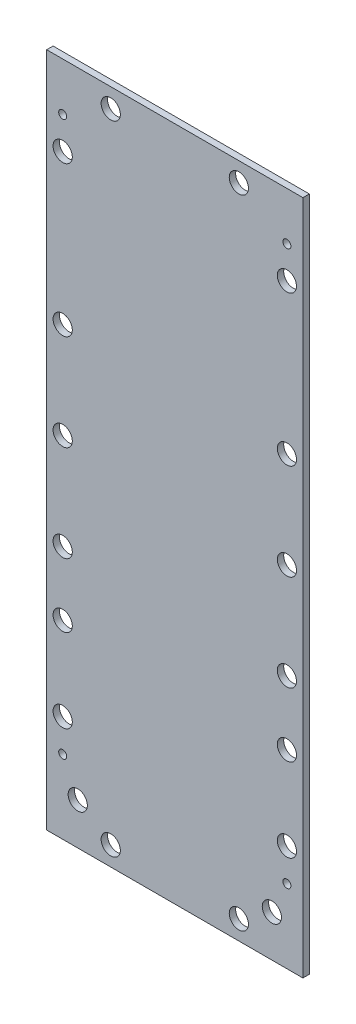
ISO-10303-21;
HEADER;
FILE_DESCRIPTION(('STEP AP214'),'2;1');
FILE_NAME('part.step','',(''),(''),'','','');
FILE_SCHEMA(('AUTOMOTIVE_DESIGN { 1 0 10303 214 1 1 1 1 }'));
ENDSEC;
DATA;
#1=APPLICATION_CONTEXT('core data for automotive mechanical design processes');
#2=APPLICATION_PROTOCOL_DEFINITION('international standard','automotive_design',2000,#1);
#3=PRODUCT_CONTEXT('',#1,'mechanical');
#4=PRODUCT('Part','Part','',(#3));
#5=PRODUCT_RELATED_PRODUCT_CATEGORY('part','',(#4));
#6=PRODUCT_DEFINITION_FORMATION('','',#4);
#7=PRODUCT_DEFINITION_CONTEXT('part definition',#1,'design');
#8=PRODUCT_DEFINITION('design','',#6,#7);
#9=PRODUCT_DEFINITION_SHAPE('','',#8);
#10=(LENGTH_UNIT() NAMED_UNIT(*) SI_UNIT(.MILLI.,.METRE.));
#11=(NAMED_UNIT(*) PLANE_ANGLE_UNIT() SI_UNIT($,.RADIAN.));
#12=(NAMED_UNIT(*) SI_UNIT($,.STERADIAN.) SOLID_ANGLE_UNIT());
#13=UNCERTAINTY_MEASURE_WITH_UNIT(LENGTH_MEASURE(1.E-05),#10,'distance_accuracy_value','');
#14=(GEOMETRIC_REPRESENTATION_CONTEXT(3) GLOBAL_UNCERTAINTY_ASSIGNED_CONTEXT((#13)) GLOBAL_UNIT_ASSIGNED_CONTEXT((#10,
#11,#12)) REPRESENTATION_CONTEXT('',''));
#15=CARTESIAN_POINT('',(0.,0.,0.));
#16=DIRECTION('',(0.,0.,1.));
#17=DIRECTION('',(1.,0.,0.));
#18=AXIS2_PLACEMENT_3D('',#15,#16,#17);
#19=CARTESIAN_POINT('',(80.,0.,2.));
#20=DIRECTION('',(0.,1.,0.));
#21=DIRECTION('',(0.,0.,1.));
#22=AXIS2_PLACEMENT_3D('',#19,#20,#21);
#23=PLANE('',#22);
#24=DIRECTION('',(1.,0.,0.));
#25=VECTOR('',#24,1.);
#26=CARTESIAN_POINT('',(80.,0.,0.));
#27=LINE('',#26,#25);
#28=CARTESIAN_POINT('',(0.,0.,0.));
#29=VERTEX_POINT('',#28);
#30=CARTESIAN_POINT('',(80.,0.,0.));
#31=VERTEX_POINT('',#30);
#32=EDGE_CURVE('E109',#29,#31,#27,.T.);
#33=ORIENTED_EDGE('',*,*,#32,.T.);
#34=DIRECTION('',(0.,0.,-1.));
#35=VECTOR('',#34,1.);
#36=CARTESIAN_POINT('',(80.,0.,2.));
#37=LINE('',#36,#35);
#38=CARTESIAN_POINT('',(80.,0.,2.));
#39=VERTEX_POINT('',#38);
#40=EDGE_CURVE('E11',#39,#31,#37,.T.);
#41=ORIENTED_EDGE('',*,*,#40,.F.);
#42=DIRECTION('',(1.,0.,0.));
#43=VECTOR('',#42,1.);
#44=CARTESIAN_POINT('',(80.,0.,2.));
#45=LINE('',#44,#43);
#46=CARTESIAN_POINT('',(0.,0.,2.));
#47=VERTEX_POINT('',#46);
#48=EDGE_CURVE('E92',#47,#39,#45,.T.);
#49=ORIENTED_EDGE('',*,*,#48,.F.);
#50=DIRECTION('',(0.,0.,-1.));
#51=VECTOR('',#50,1.);
#52=CARTESIAN_POINT('',(0.,0.,2.));
#53=LINE('',#52,#51);
#54=EDGE_CURVE('E105',#47,#29,#53,.T.);
#55=ORIENTED_EDGE('',*,*,#54,.T.);
#56=EDGE_LOOP('',(#33,#41,#49,#55));
#57=FACE_BOUND('',#56,.T.);
#58=ADVANCED_FACE('F38',(#57),#23,.F.);
#59=CARTESIAN_POINT('',(80.,211.,2.));
#60=DIRECTION('',(-1.,0.,0.));
#61=DIRECTION('',(0.,0.,1.));
#62=AXIS2_PLACEMENT_3D('',#59,#60,#61);
#63=PLANE('',#62);
#64=DIRECTION('',(0.,1.,0.));
#65=VECTOR('',#64,1.);
#66=CARTESIAN_POINT('',(80.,211.,0.));
#67=LINE('',#66,#65);
#68=CARTESIAN_POINT('',(80.,211.,0.));
#69=VERTEX_POINT('',#68);
#70=EDGE_CURVE('E97',#31,#69,#67,.T.);
#71=ORIENTED_EDGE('',*,*,#70,.T.);
#72=DIRECTION('',(0.,0.,-1.));
#73=VECTOR('',#72,1.);
#74=CARTESIAN_POINT('',(80.,211.,2.));
#75=LINE('',#74,#73);
#76=CARTESIAN_POINT('',(80.,211.,2.));
#77=VERTEX_POINT('',#76);
#78=EDGE_CURVE('E48',#77,#69,#75,.T.);
#79=ORIENTED_EDGE('',*,*,#78,.F.);
#80=DIRECTION('',(0.,1.,0.));
#81=VECTOR('',#80,1.);
#82=CARTESIAN_POINT('',(80.,211.,2.));
#83=LINE('',#82,#81);
#84=EDGE_CURVE('E87',#39,#77,#83,.T.);
#85=ORIENTED_EDGE('',*,*,#84,.F.);
#86=ORIENTED_EDGE('',*,*,#40,.T.);
#87=EDGE_LOOP('',(#71,#79,#85,#86));
#88=FACE_BOUND('',#87,.T.);
#89=ADVANCED_FACE('F96',(#88),#63,.F.);
#90=CARTESIAN_POINT('',(0.,211.,2.));
#91=DIRECTION('',(0.,-1.,0.));
#92=DIRECTION('',(0.,0.,-1.));
#93=AXIS2_PLACEMENT_3D('',#90,#91,#92);
#94=PLANE('',#93);
#95=DIRECTION('',(-1.,0.,0.));
#96=VECTOR('',#95,1.);
#97=CARTESIAN_POINT('',(0.,211.,0.));
#98=LINE('',#97,#96);
#99=CARTESIAN_POINT('',(0.,211.,0.));
#100=VERTEX_POINT('',#99);
#101=EDGE_CURVE('E74',#69,#100,#98,.T.);
#102=ORIENTED_EDGE('',*,*,#101,.T.);
#103=DIRECTION('',(0.,0.,-1.));
#104=VECTOR('',#103,1.);
#105=CARTESIAN_POINT('',(0.,211.,2.));
#106=LINE('',#105,#104);
#107=CARTESIAN_POINT('',(0.,211.,2.));
#108=VERTEX_POINT('',#107);
#109=EDGE_CURVE('E99',#108,#100,#106,.T.);
#110=ORIENTED_EDGE('',*,*,#109,.F.);
#111=DIRECTION('',(-1.,0.,0.));
#112=VECTOR('',#111,1.);
#113=CARTESIAN_POINT('',(0.,211.,2.));
#114=LINE('',#113,#112);
#115=EDGE_CURVE('E90',#77,#108,#114,.T.);
#116=ORIENTED_EDGE('',*,*,#115,.F.);
#117=ORIENTED_EDGE('',*,*,#78,.T.);
#118=EDGE_LOOP('',(#102,#110,#116,#117));
#119=FACE_BOUND('',#118,.T.);
#120=ADVANCED_FACE('F101',(#119),#94,.F.);
#121=CARTESIAN_POINT('',(0.,0.,2.));
#122=DIRECTION('',(1.,0.,0.));
#123=DIRECTION('',(0.,0.,-1.));
#124=AXIS2_PLACEMENT_3D('',#121,#122,#123);
#125=PLANE('',#124);
#126=DIRECTION('',(0.,-1.,0.));
#127=VECTOR('',#126,1.);
#128=CARTESIAN_POINT('',(0.,0.,0.));
#129=LINE('',#128,#127);
#130=EDGE_CURVE('E80',#100,#29,#129,.T.);
#131=ORIENTED_EDGE('',*,*,#130,.T.);
#132=ORIENTED_EDGE('',*,*,#54,.F.);
#133=DIRECTION('',(0.,-1.,0.));
#134=VECTOR('',#133,1.);
#135=CARTESIAN_POINT('',(0.,0.,2.));
#136=LINE('',#135,#134);
#137=EDGE_CURVE('E57',#108,#47,#136,.T.);
#138=ORIENTED_EDGE('',*,*,#137,.F.);
#139=ORIENTED_EDGE('',*,*,#109,.T.);
#140=EDGE_LOOP('',(#131,#132,#138,#139));
#141=FACE_BOUND('',#140,.T.);
#142=ADVANCED_FACE('F173',(#141),#125,.F.);
#143=CARTESIAN_POINT('',(0.,0.,2.));
#144=DIRECTION('',(0.,0.,-1.));
#145=DIRECTION('',(-1.,0.,0.));
#146=AXIS2_PLACEMENT_3D('',#143,#144,#145);
#147=PLANE('',#146);
#148=CARTESIAN_POINT('',(20.,205.,2.));
#149=DIRECTION('',(0.,0.,-1.));
#150=DIRECTION('',(-1.,0.,0.));
#151=AXIS2_PLACEMENT_3D('',#148,#149,#150);
#152=CIRCLE('',#151,3.);
#153=CARTESIAN_POINT('',(17.,205.,2.));
#154=VERTEX_POINT('',#153);
#155=EDGE_CURVE('E424',#154,#154,#152,.F.);
#156=ORIENTED_EDGE('',*,*,#155,.F.);
#157=EDGE_LOOP('',(#156));
#158=FACE_BOUND('',#157,.T.);
#159=CARTESIAN_POINT('',(4.99999999999998,33.2,2.));
#160=DIRECTION('',(0.,0.,-1.));
#161=DIRECTION('',(-1.,0.,0.));
#162=AXIS2_PLACEMENT_3D('',#159,#160,#161);
#163=CIRCLE('',#162,3.);
#164=CARTESIAN_POINT('',(1.99999999999998,33.2,2.));
#165=VERTEX_POINT('',#164);
#166=EDGE_CURVE('E439',#165,#165,#163,.F.);
#167=ORIENTED_EDGE('',*,*,#166,.F.);
#168=EDGE_LOOP('',(#167));
#169=FACE_BOUND('',#168,.T.);
#170=CARTESIAN_POINT('',(4.99999999999999,59.2,2.));
#171=DIRECTION('',(0.,0.,-1.));
#172=DIRECTION('',(-1.,0.,0.));
#173=AXIS2_PLACEMENT_3D('',#170,#171,#172);
#174=CIRCLE('',#173,3.);
#175=CARTESIAN_POINT('',(1.99999999999998,59.2,2.));
#176=VERTEX_POINT('',#175);
#177=EDGE_CURVE('E447',#176,#176,#174,.F.);
#178=ORIENTED_EDGE('',*,*,#177,.F.);
#179=EDGE_LOOP('',(#178));
#180=FACE_BOUND('',#179,.T.);
#181=CARTESIAN_POINT('',(5.00000000000002,79.2,2.));
#182=DIRECTION('',(0.,0.,-1.));
#183=DIRECTION('',(-1.,0.,0.));
#184=AXIS2_PLACEMENT_3D('',#181,#182,#183);
#185=CIRCLE('',#184,3.);
#186=CARTESIAN_POINT('',(2.00000000000001,79.2,2.));
#187=VERTEX_POINT('',#186);
#188=EDGE_CURVE('E446',#187,#187,#185,.F.);
#189=ORIENTED_EDGE('',*,*,#188,.F.);
#190=EDGE_LOOP('',(#189));
#191=FACE_BOUND('',#190,.T.);
#192=CARTESIAN_POINT('',(60.,5.99999999999999,2.));
#193=DIRECTION('',(0.,0.,-1.));
#194=DIRECTION('',(-1.,0.,0.));
#195=AXIS2_PLACEMENT_3D('',#192,#193,#194);
#196=CIRCLE('',#195,3.);
#197=CARTESIAN_POINT('',(57.,5.99999999999999,2.));
#198=VERTEX_POINT('',#197);
#199=EDGE_CURVE('E429',#198,#198,#196,.F.);
#200=ORIENTED_EDGE('',*,*,#199,.F.);
#201=EDGE_LOOP('',(#200));
#202=FACE_BOUND('',#201,.T.);
#203=CARTESIAN_POINT('',(20.,5.99999999999999,2.));
#204=DIRECTION('',(0.,0.,-1.));
#205=DIRECTION('',(-1.,0.,0.));
#206=AXIS2_PLACEMENT_3D('',#203,#204,#205);
#207=CIRCLE('',#206,2.99999999999999);
#208=CARTESIAN_POINT('',(17.,5.99999999999999,2.));
#209=VERTEX_POINT('',#208);
#210=EDGE_CURVE('E569',#209,#209,#207,.F.);
#211=ORIENTED_EDGE('',*,*,#210,.F.);
#212=EDGE_LOOP('',(#211));
#213=FACE_BOUND('',#212,.T.);
#214=CARTESIAN_POINT('',(70.3,13.,2.));
#215=DIRECTION('',(0.,0.,-1.));
#216=DIRECTION('',(-1.,0.,0.));
#217=AXIS2_PLACEMENT_3D('',#214,#215,#216);
#218=CIRCLE('',#217,3.00000000000001);
#219=CARTESIAN_POINT('',(67.3,13.,2.));
#220=VERTEX_POINT('',#219);
#221=EDGE_CURVE('E561',#220,#220,#218,.F.);
#222=ORIENTED_EDGE('',*,*,#221,.F.);
#223=EDGE_LOOP('',(#222));
#224=FACE_BOUND('',#223,.T.);
#225=CARTESIAN_POINT('',(60.,205.,2.));
#226=DIRECTION('',(0.,0.,-1.));
#227=DIRECTION('',(-1.,0.,0.));
#228=AXIS2_PLACEMENT_3D('',#225,#226,#227);
#229=CIRCLE('',#228,3.);
#230=CARTESIAN_POINT('',(57.,205.,2.));
#231=VERTEX_POINT('',#230);
#232=EDGE_CURVE('E551',#231,#231,#229,.F.);
#233=ORIENTED_EDGE('',*,*,#232,.F.);
#234=EDGE_LOOP('',(#233));
#235=FACE_BOUND('',#234,.T.);
#236=CARTESIAN_POINT('',(75.,139.2,2.));
#237=DIRECTION('',(0.,0.,-1.));
#238=DIRECTION('',(-1.,0.,0.));
#239=AXIS2_PLACEMENT_3D('',#236,#237,#238);
#240=CIRCLE('',#239,3.00000000000001);
#241=CARTESIAN_POINT('',(72.,139.2,2.));
#242=VERTEX_POINT('',#241);
#243=EDGE_CURVE('E495',#242,#242,#240,.F.);
#244=ORIENTED_EDGE('',*,*,#243,.F.);
#245=EDGE_LOOP('',(#244));
#246=FACE_BOUND('',#245,.T.);
#247=CARTESIAN_POINT('',(75.,109.2,2.));
#248=DIRECTION('',(0.,0.,-1.));
#249=DIRECTION('',(-1.,0.,0.));
#250=AXIS2_PLACEMENT_3D('',#247,#248,#249);
#251=CIRCLE('',#250,3.00000000000001);
#252=CARTESIAN_POINT('',(72.,109.2,2.));
#253=VERTEX_POINT('',#252);
#254=EDGE_CURVE('E496',#253,#253,#251,.F.);
#255=ORIENTED_EDGE('',*,*,#254,.F.);
#256=EDGE_LOOP('',(#255));
#257=FACE_BOUND('',#256,.T.);
#258=CARTESIAN_POINT('',(75.,79.2,2.));
#259=DIRECTION('',(0.,0.,-1.));
#260=DIRECTION('',(-1.,0.,0.));
#261=AXIS2_PLACEMENT_3D('',#258,#259,#260);
#262=CIRCLE('',#261,3.00000000000001);
#263=CARTESIAN_POINT('',(72.,79.2,2.));
#264=VERTEX_POINT('',#263);
#265=EDGE_CURVE('E505',#264,#264,#262,.F.);
#266=ORIENTED_EDGE('',*,*,#265,.F.);
#267=EDGE_LOOP('',(#266));
#268=FACE_BOUND('',#267,.T.);
#269=CARTESIAN_POINT('',(75.,59.2,2.));
#270=DIRECTION('',(0.,0.,-1.));
#271=DIRECTION('',(-1.,0.,0.));
#272=AXIS2_PLACEMENT_3D('',#269,#270,#271);
#273=CIRCLE('',#272,3.00000000000001);
#274=CARTESIAN_POINT('',(72.,59.2,2.));
#275=VERTEX_POINT('',#274);
#276=EDGE_CURVE('E513',#275,#275,#273,.F.);
#277=ORIENTED_EDGE('',*,*,#276,.F.);
#278=EDGE_LOOP('',(#277));
#279=FACE_BOUND('',#278,.T.);
#280=CARTESIAN_POINT('',(5.00000000000002,109.2,2.));
#281=DIRECTION('',(0.,0.,-1.));
#282=DIRECTION('',(-1.,0.,0.));
#283=AXIS2_PLACEMENT_3D('',#280,#281,#282);
#284=CIRCLE('',#283,3.);
#285=CARTESIAN_POINT('',(2.00000000000002,109.2,2.));
#286=VERTEX_POINT('',#285);
#287=EDGE_CURVE('E464',#286,#286,#284,.F.);
#288=ORIENTED_EDGE('',*,*,#287,.F.);
#289=EDGE_LOOP('',(#288));
#290=FACE_BOUND('',#289,.T.);
#291=CARTESIAN_POINT('',(5.00000000000002,139.2,2.));
#292=DIRECTION('',(0.,0.,-1.));
#293=DIRECTION('',(-1.,0.,0.));
#294=AXIS2_PLACEMENT_3D('',#291,#292,#293);
#295=CIRCLE('',#294,3.);
#296=CARTESIAN_POINT('',(2.00000000000002,139.2,2.));
#297=VERTEX_POINT('',#296);
#298=EDGE_CURVE('E463',#297,#297,#295,.F.);
#299=ORIENTED_EDGE('',*,*,#298,.F.);
#300=EDGE_LOOP('',(#299));
#301=FACE_BOUND('',#300,.T.);
#302=CARTESIAN_POINT('',(5.00000000000003,186.,2.));
#303=DIRECTION('',(0.,0.,-1.));
#304=DIRECTION('',(-1.,0.,0.));
#305=AXIS2_PLACEMENT_3D('',#302,#303,#304);
#306=CIRCLE('',#305,3.);
#307=CARTESIAN_POINT('',(2.00000000000003,186.,2.));
#308=VERTEX_POINT('',#307);
#309=EDGE_CURVE('E480',#308,#308,#306,.F.);
#310=ORIENTED_EDGE('',*,*,#309,.F.);
#311=EDGE_LOOP('',(#310));
#312=FACE_BOUND('',#311,.T.);
#313=CARTESIAN_POINT('',(75.,33.2,2.));
#314=DIRECTION('',(0.,0.,-1.));
#315=DIRECTION('',(-1.,0.,0.));
#316=AXIS2_PLACEMENT_3D('',#313,#314,#315);
#317=CIRCLE('',#316,3.00000000000001);
#318=CARTESIAN_POINT('',(72.,33.2,2.));
#319=VERTEX_POINT('',#318);
#320=EDGE_CURVE('E479',#319,#319,#317,.F.);
#321=ORIENTED_EDGE('',*,*,#320,.F.);
#322=EDGE_LOOP('',(#321));
#323=FACE_BOUND('',#322,.T.);
#324=CARTESIAN_POINT('',(9.7,13.,2.));
#325=DIRECTION('',(0.,0.,-1.));
#326=DIRECTION('',(-1.,0.,0.));
#327=AXIS2_PLACEMENT_3D('',#324,#325,#326);
#328=CIRCLE('',#327,3.);
#329=CARTESIAN_POINT('',(6.7,13.,2.));
#330=VERTEX_POINT('',#329);
#331=EDGE_CURVE('E560',#330,#330,#328,.F.);
#332=ORIENTED_EDGE('',*,*,#331,.F.);
#333=EDGE_LOOP('',(#332));
#334=FACE_BOUND('',#333,.T.);
#335=CARTESIAN_POINT('',(75.,186.,2.));
#336=DIRECTION('',(0.,0.,-1.));
#337=DIRECTION('',(-1.,0.,0.));
#338=AXIS2_PLACEMENT_3D('',#335,#336,#337);
#339=CIRCLE('',#338,3.00000000000001);
#340=CARTESIAN_POINT('',(72.,186.,2.));
#341=VERTEX_POINT('',#340);
#342=EDGE_CURVE('E526',#341,#341,#339,.F.);
#343=ORIENTED_EDGE('',*,*,#342,.F.);
#344=EDGE_LOOP('',(#343));
#345=FACE_BOUND('',#344,.T.);
#346=CARTESIAN_POINT('',(75.,196.,2.));
#347=DIRECTION('',(0.,0.,-1.));
#348=DIRECTION('',(-1.,0.,0.));
#349=AXIS2_PLACEMENT_3D('',#346,#347,#348);
#350=CIRCLE('',#349,1.25);
#351=CARTESIAN_POINT('',(73.75,196.,2.));
#352=VERTEX_POINT('',#351);
#353=EDGE_CURVE('E41',#352,#352,#350,.T.);
#354=ORIENTED_EDGE('',*,*,#353,.T.);
#355=EDGE_LOOP('',(#354));
#356=FACE_BOUND('',#355,.T.);
#357=CARTESIAN_POINT('',(5.00000000000003,196.,2.));
#358=DIRECTION('',(0.,0.,-1.));
#359=DIRECTION('',(-1.,0.,0.));
#360=AXIS2_PLACEMENT_3D('',#357,#358,#359);
#361=CIRCLE('',#360,1.25);
#362=CARTESIAN_POINT('',(3.75000000000003,196.,2.));
#363=VERTEX_POINT('',#362);
#364=EDGE_CURVE('E135',#363,#363,#361,.T.);
#365=ORIENTED_EDGE('',*,*,#364,.T.);
#366=EDGE_LOOP('',(#365));
#367=FACE_BOUND('',#366,.T.);
#368=CARTESIAN_POINT('',(75.,23.,2.));
#369=DIRECTION('',(0.,0.,-1.));
#370=DIRECTION('',(-1.,0.,0.));
#371=AXIS2_PLACEMENT_3D('',#368,#369,#370);
#372=CIRCLE('',#371,1.25);
#373=CARTESIAN_POINT('',(73.75,23.,2.));
#374=VERTEX_POINT('',#373);
#375=EDGE_CURVE('E123',#374,#374,#372,.T.);
#376=ORIENTED_EDGE('',*,*,#375,.T.);
#377=EDGE_LOOP('',(#376));
#378=FACE_BOUND('',#377,.T.);
#379=CARTESIAN_POINT('',(5.00000000000003,23.,2.));
#380=DIRECTION('',(0.,0.,-1.));
#381=DIRECTION('',(-1.,0.,0.));
#382=AXIS2_PLACEMENT_3D('',#379,#380,#381);
#383=CIRCLE('',#382,1.25);
#384=CARTESIAN_POINT('',(3.75000000000003,23.,2.));
#385=VERTEX_POINT('',#384);
#386=EDGE_CURVE('E113',#385,#385,#383,.T.);
#387=ORIENTED_EDGE('',*,*,#386,.T.);
#388=EDGE_LOOP('',(#387));
#389=FACE_BOUND('',#388,.T.);
#390=ORIENTED_EDGE('',*,*,#48,.T.);
#391=ORIENTED_EDGE('',*,*,#84,.T.);
#392=ORIENTED_EDGE('',*,*,#115,.T.);
#393=ORIENTED_EDGE('',*,*,#137,.T.);
#394=EDGE_LOOP('',(#390,#391,#392,#393));
#395=FACE_BOUND('',#394,.T.);
#396=ADVANCED_FACE('F88',(#158,#169,#180,#191,#202,#213,#224,#235,#246,#257,#268,#279,#290,#301,
#312,#323,#334,#345,#356,#367,#378,#389,#395),#147,.F.);
#397=CARTESIAN_POINT('',(0.,0.,0.));
#398=DIRECTION('',(0.,0.,-1.));
#399=DIRECTION('',(-1.,0.,0.));
#400=AXIS2_PLACEMENT_3D('',#397,#398,#399);
#401=PLANE('',#400);
#402=CARTESIAN_POINT('',(20.,205.,0.));
#403=DIRECTION('',(0.,0.,-1.));
#404=DIRECTION('',(-1.,0.,0.));
#405=AXIS2_PLACEMENT_3D('',#402,#403,#404);
#406=CIRCLE('',#405,3.);
#407=CARTESIAN_POINT('',(17.,205.,0.));
#408=VERTEX_POINT('',#407);
#409=EDGE_CURVE('E427',#408,#408,#406,.T.);
#410=ORIENTED_EDGE('',*,*,#409,.F.);
#411=EDGE_LOOP('',(#410));
#412=FACE_BOUND('',#411,.T.);
#413=CARTESIAN_POINT('',(4.99999999999998,33.2,0.));
#414=DIRECTION('',(0.,0.,-1.));
#415=DIRECTION('',(-1.,0.,0.));
#416=AXIS2_PLACEMENT_3D('',#413,#414,#415);
#417=CIRCLE('',#416,3.);
#418=CARTESIAN_POINT('',(1.99999999999998,33.2,0.));
#419=VERTEX_POINT('',#418);
#420=EDGE_CURVE('E433',#419,#419,#417,.T.);
#421=ORIENTED_EDGE('',*,*,#420,.F.);
#422=EDGE_LOOP('',(#421));
#423=FACE_BOUND('',#422,.T.);
#424=CARTESIAN_POINT('',(4.99999999999999,59.2,0.));
#425=DIRECTION('',(0.,0.,-1.));
#426=DIRECTION('',(-1.,0.,0.));
#427=AXIS2_PLACEMENT_3D('',#424,#425,#426);
#428=CIRCLE('',#427,3.);
#429=CARTESIAN_POINT('',(1.99999999999998,59.2,0.));
#430=VERTEX_POINT('',#429);
#431=EDGE_CURVE('E452',#430,#430,#428,.T.);
#432=ORIENTED_EDGE('',*,*,#431,.F.);
#433=EDGE_LOOP('',(#432));
#434=FACE_BOUND('',#433,.T.);
#435=CARTESIAN_POINT('',(5.00000000000002,79.2,0.));
#436=DIRECTION('',(0.,0.,-1.));
#437=DIRECTION('',(-1.,0.,0.));
#438=AXIS2_PLACEMENT_3D('',#435,#436,#437);
#439=CIRCLE('',#438,3.);
#440=CARTESIAN_POINT('',(2.00000000000001,79.2,0.));
#441=VERTEX_POINT('',#440);
#442=EDGE_CURVE('E442',#441,#441,#439,.T.);
#443=ORIENTED_EDGE('',*,*,#442,.F.);
#444=EDGE_LOOP('',(#443));
#445=FACE_BOUND('',#444,.T.);
#446=CARTESIAN_POINT('',(60.,5.99999999999999,0.));
#447=DIRECTION('',(0.,0.,-1.));
#448=DIRECTION('',(-1.,0.,0.));
#449=AXIS2_PLACEMENT_3D('',#446,#447,#448);
#450=CIRCLE('',#449,3.);
#451=CARTESIAN_POINT('',(57.,5.99999999999999,0.));
#452=VERTEX_POINT('',#451);
#453=EDGE_CURVE('E436',#452,#452,#450,.T.);
#454=ORIENTED_EDGE('',*,*,#453,.F.);
#455=EDGE_LOOP('',(#454));
#456=FACE_BOUND('',#455,.T.);
#457=CARTESIAN_POINT('',(20.,5.99999999999999,0.));
#458=DIRECTION('',(0.,0.,-1.));
#459=DIRECTION('',(-1.,0.,0.));
#460=AXIS2_PLACEMENT_3D('',#457,#458,#459);
#461=CIRCLE('',#460,2.99999999999999);
#462=CARTESIAN_POINT('',(17.,5.99999999999999,0.));
#463=VERTEX_POINT('',#462);
#464=EDGE_CURVE('E565',#463,#463,#461,.T.);
#465=ORIENTED_EDGE('',*,*,#464,.F.);
#466=EDGE_LOOP('',(#465));
#467=FACE_BOUND('',#466,.T.);
#468=CARTESIAN_POINT('',(70.3,13.,0.));
#469=DIRECTION('',(0.,0.,-1.));
#470=DIRECTION('',(-1.,0.,0.));
#471=AXIS2_PLACEMENT_3D('',#468,#469,#470);
#472=CIRCLE('',#471,3.00000000000001);
#473=CARTESIAN_POINT('',(67.3,13.,0.));
#474=VERTEX_POINT('',#473);
#475=EDGE_CURVE('E555',#474,#474,#472,.T.);
#476=ORIENTED_EDGE('',*,*,#475,.F.);
#477=EDGE_LOOP('',(#476));
#478=FACE_BOUND('',#477,.T.);
#479=CARTESIAN_POINT('',(60.,205.,0.));
#480=DIRECTION('',(0.,0.,-1.));
#481=DIRECTION('',(-1.,0.,0.));
#482=AXIS2_PLACEMENT_3D('',#479,#480,#481);
#483=CIRCLE('',#482,3.);
#484=CARTESIAN_POINT('',(57.,205.,0.));
#485=VERTEX_POINT('',#484);
#486=EDGE_CURVE('E556',#485,#485,#483,.T.);
#487=ORIENTED_EDGE('',*,*,#486,.F.);
#488=EDGE_LOOP('',(#487));
#489=FACE_BOUND('',#488,.T.);
#490=CARTESIAN_POINT('',(75.,139.2,0.));
#491=DIRECTION('',(0.,0.,-1.));
#492=DIRECTION('',(-1.,0.,0.));
#493=AXIS2_PLACEMENT_3D('',#490,#491,#492);
#494=CIRCLE('',#493,3.00000000000001);
#495=CARTESIAN_POINT('',(72.,139.2,0.));
#496=VERTEX_POINT('',#495);
#497=EDGE_CURVE('E491',#496,#496,#494,.T.);
#498=ORIENTED_EDGE('',*,*,#497,.F.);
#499=EDGE_LOOP('',(#498));
#500=FACE_BOUND('',#499,.T.);
#501=CARTESIAN_POINT('',(75.,109.2,0.));
#502=DIRECTION('',(0.,0.,-1.));
#503=DIRECTION('',(-1.,0.,0.));
#504=AXIS2_PLACEMENT_3D('',#501,#502,#503);
#505=CIRCLE('',#504,3.00000000000001);
#506=CARTESIAN_POINT('',(72.,109.2,0.));
#507=VERTEX_POINT('',#506);
#508=EDGE_CURVE('E501',#507,#507,#505,.T.);
#509=ORIENTED_EDGE('',*,*,#508,.F.);
#510=EDGE_LOOP('',(#509));
#511=FACE_BOUND('',#510,.T.);
#512=CARTESIAN_POINT('',(75.,79.2,0.));
#513=DIRECTION('',(0.,0.,-1.));
#514=DIRECTION('',(-1.,0.,0.));
#515=AXIS2_PLACEMENT_3D('',#512,#513,#514);
#516=CIRCLE('',#515,3.00000000000001);
#517=CARTESIAN_POINT('',(72.,79.2,0.));
#518=VERTEX_POINT('',#517);
#519=EDGE_CURVE('E509',#518,#518,#516,.T.);
#520=ORIENTED_EDGE('',*,*,#519,.F.);
#521=EDGE_LOOP('',(#520));
#522=FACE_BOUND('',#521,.T.);
#523=CARTESIAN_POINT('',(75.,59.2,0.));
#524=DIRECTION('',(0.,0.,-1.));
#525=DIRECTION('',(-1.,0.,0.));
#526=AXIS2_PLACEMENT_3D('',#523,#524,#525);
#527=CIRCLE('',#526,3.00000000000001);
#528=CARTESIAN_POINT('',(72.,59.2,0.));
#529=VERTEX_POINT('',#528);
#530=EDGE_CURVE('E484',#529,#529,#527,.T.);
#531=ORIENTED_EDGE('',*,*,#530,.F.);
#532=EDGE_LOOP('',(#531));
#533=FACE_BOUND('',#532,.T.);
#534=CARTESIAN_POINT('',(5.00000000000002,109.2,0.));
#535=DIRECTION('',(0.,0.,-1.));
#536=DIRECTION('',(-1.,0.,0.));
#537=AXIS2_PLACEMENT_3D('',#534,#535,#536);
#538=CIRCLE('',#537,3.);
#539=CARTESIAN_POINT('',(2.00000000000002,109.2,0.));
#540=VERTEX_POINT('',#539);
#541=EDGE_CURVE('E451',#540,#540,#538,.T.);
#542=ORIENTED_EDGE('',*,*,#541,.F.);
#543=EDGE_LOOP('',(#542));
#544=FACE_BOUND('',#543,.T.);
#545=CARTESIAN_POINT('',(5.00000000000002,139.2,0.));
#546=DIRECTION('',(0.,0.,-1.));
#547=DIRECTION('',(-1.,0.,0.));
#548=AXIS2_PLACEMENT_3D('',#545,#546,#547);
#549=CIRCLE('',#548,3.);
#550=CARTESIAN_POINT('',(2.00000000000002,139.2,0.));
#551=VERTEX_POINT('',#550);
#552=EDGE_CURVE('E459',#551,#551,#549,.T.);
#553=ORIENTED_EDGE('',*,*,#552,.F.);
#554=EDGE_LOOP('',(#553));
#555=FACE_BOUND('',#554,.T.);
#556=CARTESIAN_POINT('',(5.00000000000003,186.,0.));
#557=DIRECTION('',(0.,0.,-1.));
#558=DIRECTION('',(-1.,0.,0.));
#559=AXIS2_PLACEMENT_3D('',#556,#557,#558);
#560=CIRCLE('',#559,3.);
#561=CARTESIAN_POINT('',(2.00000000000003,186.,0.));
#562=VERTEX_POINT('',#561);
#563=EDGE_CURVE('E468',#562,#562,#560,.T.);
#564=ORIENTED_EDGE('',*,*,#563,.F.);
#565=EDGE_LOOP('',(#564));
#566=FACE_BOUND('',#565,.T.);
#567=CARTESIAN_POINT('',(75.,33.2,0.));
#568=DIRECTION('',(0.,0.,-1.));
#569=DIRECTION('',(-1.,0.,0.));
#570=AXIS2_PLACEMENT_3D('',#567,#568,#569);
#571=CIRCLE('',#570,3.00000000000001);
#572=CARTESIAN_POINT('',(72.,33.2,0.));
#573=VERTEX_POINT('',#572);
#574=EDGE_CURVE('E475',#573,#573,#571,.T.);
#575=ORIENTED_EDGE('',*,*,#574,.F.);
#576=EDGE_LOOP('',(#575));
#577=FACE_BOUND('',#576,.T.);
#578=CARTESIAN_POINT('',(9.7,13.,0.));
#579=DIRECTION('',(0.,0.,-1.));
#580=DIRECTION('',(-1.,0.,0.));
#581=AXIS2_PLACEMENT_3D('',#578,#579,#580);
#582=CIRCLE('',#581,3.);
#583=CARTESIAN_POINT('',(6.7,13.,0.));
#584=VERTEX_POINT('',#583);
#585=EDGE_CURVE('E582',#584,#584,#582,.T.);
#586=ORIENTED_EDGE('',*,*,#585,.F.);
#587=EDGE_LOOP('',(#586));
#588=FACE_BOUND('',#587,.T.);
#589=CARTESIAN_POINT('',(75.,186.,0.));
#590=DIRECTION('',(0.,0.,-1.));
#591=DIRECTION('',(-1.,0.,0.));
#592=AXIS2_PLACEMENT_3D('',#589,#590,#591);
#593=CIRCLE('',#592,3.00000000000001);
#594=CARTESIAN_POINT('',(72.,186.,0.));
#595=VERTEX_POINT('',#594);
#596=EDGE_CURVE('E500',#595,#595,#593,.T.);
#597=ORIENTED_EDGE('',*,*,#596,.F.);
#598=EDGE_LOOP('',(#597));
#599=FACE_BOUND('',#598,.T.);
#600=CARTESIAN_POINT('',(75.,196.,0.));
#601=DIRECTION('',(0.,0.,-1.));
#602=DIRECTION('',(-1.,0.,0.));
#603=AXIS2_PLACEMENT_3D('',#600,#601,#602);
#604=CIRCLE('',#603,1.25);
#605=CARTESIAN_POINT('',(73.75,196.,0.));
#606=VERTEX_POINT('',#605);
#607=EDGE_CURVE('E530',#606,#606,#604,.T.);
#608=ORIENTED_EDGE('',*,*,#607,.F.);
#609=EDGE_LOOP('',(#608));
#610=FACE_BOUND('',#609,.T.);
#611=CARTESIAN_POINT('',(5.00000000000003,196.,0.));
#612=DIRECTION('',(0.,0.,-1.));
#613=DIRECTION('',(-1.,0.,0.));
#614=AXIS2_PLACEMENT_3D('',#611,#612,#613);
#615=CIRCLE('',#614,1.25);
#616=CARTESIAN_POINT('',(3.75000000000003,196.,0.));
#617=VERTEX_POINT('',#616);
#618=EDGE_CURVE('E141',#617,#617,#615,.T.);
#619=ORIENTED_EDGE('',*,*,#618,.F.);
#620=EDGE_LOOP('',(#619));
#621=FACE_BOUND('',#620,.T.);
#622=CARTESIAN_POINT('',(75.,23.,0.));
#623=DIRECTION('',(0.,0.,-1.));
#624=DIRECTION('',(-1.,0.,0.));
#625=AXIS2_PLACEMENT_3D('',#622,#623,#624);
#626=CIRCLE('',#625,1.25);
#627=CARTESIAN_POINT('',(73.75,23.,0.));
#628=VERTEX_POINT('',#627);
#629=EDGE_CURVE('E127',#628,#628,#626,.T.);
#630=ORIENTED_EDGE('',*,*,#629,.F.);
#631=EDGE_LOOP('',(#630));
#632=FACE_BOUND('',#631,.T.);
#633=CARTESIAN_POINT('',(5.00000000000003,23.,0.));
#634=DIRECTION('',(0.,0.,-1.));
#635=DIRECTION('',(-1.,0.,0.));
#636=AXIS2_PLACEMENT_3D('',#633,#634,#635);
#637=CIRCLE('',#636,1.25);
#638=CARTESIAN_POINT('',(3.75000000000003,23.,0.));
#639=VERTEX_POINT('',#638);
#640=EDGE_CURVE('E126',#639,#639,#637,.T.);
#641=ORIENTED_EDGE('',*,*,#640,.F.);
#642=EDGE_LOOP('',(#641));
#643=FACE_BOUND('',#642,.T.);
#644=ORIENTED_EDGE('',*,*,#32,.F.);
#645=ORIENTED_EDGE('',*,*,#130,.F.);
#646=ORIENTED_EDGE('',*,*,#101,.F.);
#647=ORIENTED_EDGE('',*,*,#70,.F.);
#648=EDGE_LOOP('',(#644,#645,#646,#647));
#649=FACE_BOUND('',#648,.T.);
#650=ADVANCED_FACE('F154',(#412,#423,#434,#445,#456,#467,#478,#489,#500,#511,#522,#533,#544,
#555,#566,#577,#588,#599,#610,#621,#632,#643,#649),#401,.T.);
#651=CARTESIAN_POINT('',(5.00000000000003,23.,0.));
#652=DIRECTION('',(0.,0.,-1.));
#653=DIRECTION('',(-1.,0.,0.));
#654=AXIS2_PLACEMENT_3D('',#651,#652,#653);
#655=CYLINDRICAL_SURFACE('',#654,1.25);
#656=ORIENTED_EDGE('',*,*,#640,.T.);
#657=EDGE_LOOP('',(#656));
#658=FACE_BOUND('',#657,.T.);
#659=ORIENTED_EDGE('',*,*,#386,.F.);
#660=EDGE_LOOP('',(#659));
#661=FACE_BOUND('',#660,.T.);
#662=ADVANCED_FACE('F151',(#658,#661),#655,.F.);
#663=CARTESIAN_POINT('',(75.,23.,0.));
#664=DIRECTION('',(0.,0.,-1.));
#665=DIRECTION('',(-1.,0.,0.));
#666=AXIS2_PLACEMENT_3D('',#663,#664,#665);
#667=CYLINDRICAL_SURFACE('',#666,1.25);
#668=ORIENTED_EDGE('',*,*,#629,.T.);
#669=EDGE_LOOP('',(#668));
#670=FACE_BOUND('',#669,.T.);
#671=ORIENTED_EDGE('',*,*,#375,.F.);
#672=EDGE_LOOP('',(#671));
#673=FACE_BOUND('',#672,.T.);
#674=ADVANCED_FACE('F153',(#670,#673),#667,.F.);
#675=CARTESIAN_POINT('',(5.00000000000003,196.,0.));
#676=DIRECTION('',(0.,0.,-1.));
#677=DIRECTION('',(-1.,0.,0.));
#678=AXIS2_PLACEMENT_3D('',#675,#676,#677);
#679=CYLINDRICAL_SURFACE('',#678,1.25);
#680=ORIENTED_EDGE('',*,*,#618,.T.);
#681=EDGE_LOOP('',(#680));
#682=FACE_BOUND('',#681,.T.);
#683=ORIENTED_EDGE('',*,*,#364,.F.);
#684=EDGE_LOOP('',(#683));
#685=FACE_BOUND('',#684,.T.);
#686=ADVANCED_FACE('F161',(#682,#685),#679,.F.);
#687=CARTESIAN_POINT('',(75.,196.,0.));
#688=DIRECTION('',(0.,0.,-1.));
#689=DIRECTION('',(-1.,0.,0.));
#690=AXIS2_PLACEMENT_3D('',#687,#688,#689);
#691=CYLINDRICAL_SURFACE('',#690,1.25);
#692=ORIENTED_EDGE('',*,*,#607,.T.);
#693=EDGE_LOOP('',(#692));
#694=FACE_BOUND('',#693,.T.);
#695=ORIENTED_EDGE('',*,*,#353,.F.);
#696=EDGE_LOOP('',(#695));
#697=FACE_BOUND('',#696,.T.);
#698=ADVANCED_FACE('F229',(#694,#697),#691,.F.);
#699=CARTESIAN_POINT('',(75.,186.,10.4852813742386));
#700=DIRECTION('',(0.,0.,-1.));
#701=DIRECTION('',(-1.,0.,0.));
#702=AXIS2_PLACEMENT_3D('',#699,#700,#701);
#703=CYLINDRICAL_SURFACE('',#702,3.00000000000001);
#704=ORIENTED_EDGE('',*,*,#342,.T.);
#705=EDGE_LOOP('',(#704));
#706=FACE_BOUND('',#705,.T.);
#707=ORIENTED_EDGE('',*,*,#596,.T.);
#708=EDGE_LOOP('',(#707));
#709=FACE_BOUND('',#708,.T.);
#710=ADVANCED_FACE('F237',(#706,#709),#703,.F.);
#711=CARTESIAN_POINT('',(9.7,13.,10.4852813742386));
#712=DIRECTION('',(0.,0.,-1.));
#713=DIRECTION('',(-1.,0.,0.));
#714=AXIS2_PLACEMENT_3D('',#711,#712,#713);
#715=CYLINDRICAL_SURFACE('',#714,3.);
#716=ORIENTED_EDGE('',*,*,#331,.T.);
#717=EDGE_LOOP('',(#716));
#718=FACE_BOUND('',#717,.T.);
#719=ORIENTED_EDGE('',*,*,#585,.T.);
#720=EDGE_LOOP('',(#719));
#721=FACE_BOUND('',#720,.T.);
#722=ADVANCED_FACE('F245',(#718,#721),#715,.F.);
#723=CARTESIAN_POINT('',(75.,33.2,10.4852813742386));
#724=DIRECTION('',(0.,0.,-1.));
#725=DIRECTION('',(-1.,0.,0.));
#726=AXIS2_PLACEMENT_3D('',#723,#724,#725);
#727=CYLINDRICAL_SURFACE('',#726,3.00000000000001);
#728=ORIENTED_EDGE('',*,*,#320,.T.);
#729=EDGE_LOOP('',(#728));
#730=FACE_BOUND('',#729,.T.);
#731=ORIENTED_EDGE('',*,*,#574,.T.);
#732=EDGE_LOOP('',(#731));
#733=FACE_BOUND('',#732,.T.);
#734=ADVANCED_FACE('F254',(#730,#733),#727,.F.);
#735=CARTESIAN_POINT('',(5.00000000000003,186.,10.4852813742386));
#736=DIRECTION('',(0.,0.,-1.));
#737=DIRECTION('',(-1.,0.,0.));
#738=AXIS2_PLACEMENT_3D('',#735,#736,#737);
#739=CYLINDRICAL_SURFACE('',#738,3.);
#740=ORIENTED_EDGE('',*,*,#309,.T.);
#741=EDGE_LOOP('',(#740));
#742=FACE_BOUND('',#741,.T.);
#743=ORIENTED_EDGE('',*,*,#563,.T.);
#744=EDGE_LOOP('',(#743));
#745=FACE_BOUND('',#744,.T.);
#746=ADVANCED_FACE('F263',(#742,#745),#739,.F.);
#747=CARTESIAN_POINT('',(5.00000000000002,139.2,10.4852813742386));
#748=DIRECTION('',(0.,0.,-1.));
#749=DIRECTION('',(-1.,0.,0.));
#750=AXIS2_PLACEMENT_3D('',#747,#748,#749);
#751=CYLINDRICAL_SURFACE('',#750,3.);
#752=ORIENTED_EDGE('',*,*,#298,.T.);
#753=EDGE_LOOP('',(#752));
#754=FACE_BOUND('',#753,.T.);
#755=ORIENTED_EDGE('',*,*,#552,.T.);
#756=EDGE_LOOP('',(#755));
#757=FACE_BOUND('',#756,.T.);
#758=ADVANCED_FACE('F272',(#754,#757),#751,.F.);
#759=CARTESIAN_POINT('',(5.00000000000002,109.2,10.4852813742386));
#760=DIRECTION('',(0.,0.,-1.));
#761=DIRECTION('',(-1.,0.,0.));
#762=AXIS2_PLACEMENT_3D('',#759,#760,#761);
#763=CYLINDRICAL_SURFACE('',#762,3.);
#764=ORIENTED_EDGE('',*,*,#287,.T.);
#765=EDGE_LOOP('',(#764));
#766=FACE_BOUND('',#765,.T.);
#767=ORIENTED_EDGE('',*,*,#541,.T.);
#768=EDGE_LOOP('',(#767));
#769=FACE_BOUND('',#768,.T.);
#770=ADVANCED_FACE('F281',(#766,#769),#763,.F.);
#771=CARTESIAN_POINT('',(75.,59.2,10.4852813742386));
#772=DIRECTION('',(0.,0.,-1.));
#773=DIRECTION('',(-1.,0.,0.));
#774=AXIS2_PLACEMENT_3D('',#771,#772,#773);
#775=CYLINDRICAL_SURFACE('',#774,3.00000000000001);
#776=ORIENTED_EDGE('',*,*,#276,.T.);
#777=EDGE_LOOP('',(#776));
#778=FACE_BOUND('',#777,.T.);
#779=ORIENTED_EDGE('',*,*,#530,.T.);
#780=EDGE_LOOP('',(#779));
#781=FACE_BOUND('',#780,.T.);
#782=ADVANCED_FACE('F290',(#778,#781),#775,.F.);
#783=CARTESIAN_POINT('',(75.,79.2,10.4852813742386));
#784=DIRECTION('',(0.,0.,-1.));
#785=DIRECTION('',(-1.,0.,0.));
#786=AXIS2_PLACEMENT_3D('',#783,#784,#785);
#787=CYLINDRICAL_SURFACE('',#786,3.00000000000001);
#788=ORIENTED_EDGE('',*,*,#265,.T.);
#789=EDGE_LOOP('',(#788));
#790=FACE_BOUND('',#789,.T.);
#791=ORIENTED_EDGE('',*,*,#519,.T.);
#792=EDGE_LOOP('',(#791));
#793=FACE_BOUND('',#792,.T.);
#794=ADVANCED_FACE('F299',(#790,#793),#787,.F.);
#795=CARTESIAN_POINT('',(75.,109.2,10.4852813742386));
#796=DIRECTION('',(0.,0.,-1.));
#797=DIRECTION('',(-1.,0.,0.));
#798=AXIS2_PLACEMENT_3D('',#795,#796,#797);
#799=CYLINDRICAL_SURFACE('',#798,3.00000000000001);
#800=ORIENTED_EDGE('',*,*,#254,.T.);
#801=EDGE_LOOP('',(#800));
#802=FACE_BOUND('',#801,.T.);
#803=ORIENTED_EDGE('',*,*,#508,.T.);
#804=EDGE_LOOP('',(#803));
#805=FACE_BOUND('',#804,.T.);
#806=ADVANCED_FACE('F308',(#802,#805),#799,.F.);
#807=CARTESIAN_POINT('',(75.,139.2,10.4852813742386));
#808=DIRECTION('',(0.,0.,-1.));
#809=DIRECTION('',(-1.,0.,0.));
#810=AXIS2_PLACEMENT_3D('',#807,#808,#809);
#811=CYLINDRICAL_SURFACE('',#810,3.00000000000001);
#812=ORIENTED_EDGE('',*,*,#243,.T.);
#813=EDGE_LOOP('',(#812));
#814=FACE_BOUND('',#813,.T.);
#815=ORIENTED_EDGE('',*,*,#497,.T.);
#816=EDGE_LOOP('',(#815));
#817=FACE_BOUND('',#816,.T.);
#818=ADVANCED_FACE('F317',(#814,#817),#811,.F.);
#819=CARTESIAN_POINT('',(60.,205.,10.4852813742386));
#820=DIRECTION('',(0.,0.,-1.));
#821=DIRECTION('',(-1.,0.,0.));
#822=AXIS2_PLACEMENT_3D('',#819,#820,#821);
#823=CYLINDRICAL_SURFACE('',#822,3.);
#824=ORIENTED_EDGE('',*,*,#232,.T.);
#825=EDGE_LOOP('',(#824));
#826=FACE_BOUND('',#825,.T.);
#827=ORIENTED_EDGE('',*,*,#486,.T.);
#828=EDGE_LOOP('',(#827));
#829=FACE_BOUND('',#828,.T.);
#830=ADVANCED_FACE('F326',(#826,#829),#823,.F.);
#831=CARTESIAN_POINT('',(70.3,13.,10.4852813742386));
#832=DIRECTION('',(0.,0.,-1.));
#833=DIRECTION('',(-1.,0.,0.));
#834=AXIS2_PLACEMENT_3D('',#831,#832,#833);
#835=CYLINDRICAL_SURFACE('',#834,3.00000000000001);
#836=ORIENTED_EDGE('',*,*,#221,.T.);
#837=EDGE_LOOP('',(#836));
#838=FACE_BOUND('',#837,.T.);
#839=ORIENTED_EDGE('',*,*,#475,.T.);
#840=EDGE_LOOP('',(#839));
#841=FACE_BOUND('',#840,.T.);
#842=ADVANCED_FACE('F335',(#838,#841),#835,.F.);
#843=CARTESIAN_POINT('',(20.,5.99999999999999,10.4852813742386));
#844=DIRECTION('',(0.,0.,-1.));
#845=DIRECTION('',(-1.,0.,0.));
#846=AXIS2_PLACEMENT_3D('',#843,#844,#845);
#847=CYLINDRICAL_SURFACE('',#846,2.99999999999999);
#848=ORIENTED_EDGE('',*,*,#210,.T.);
#849=EDGE_LOOP('',(#848));
#850=FACE_BOUND('',#849,.T.);
#851=ORIENTED_EDGE('',*,*,#464,.T.);
#852=EDGE_LOOP('',(#851));
#853=FACE_BOUND('',#852,.T.);
#854=ADVANCED_FACE('F344',(#850,#853),#847,.F.);
#855=CARTESIAN_POINT('',(60.,5.99999999999999,10.4852813742386));
#856=DIRECTION('',(0.,0.,-1.));
#857=DIRECTION('',(-1.,0.,0.));
#858=AXIS2_PLACEMENT_3D('',#855,#856,#857);
#859=CYLINDRICAL_SURFACE('',#858,3.);
#860=ORIENTED_EDGE('',*,*,#199,.T.);
#861=EDGE_LOOP('',(#860));
#862=FACE_BOUND('',#861,.T.);
#863=ORIENTED_EDGE('',*,*,#453,.T.);
#864=EDGE_LOOP('',(#863));
#865=FACE_BOUND('',#864,.T.);
#866=ADVANCED_FACE('F353',(#862,#865),#859,.F.);
#867=CARTESIAN_POINT('',(5.00000000000002,79.2,10.4852813742386));
#868=DIRECTION('',(0.,0.,-1.));
#869=DIRECTION('',(-1.,0.,0.));
#870=AXIS2_PLACEMENT_3D('',#867,#868,#869);
#871=CYLINDRICAL_SURFACE('',#870,3.);
#872=ORIENTED_EDGE('',*,*,#188,.T.);
#873=EDGE_LOOP('',(#872));
#874=FACE_BOUND('',#873,.T.);
#875=ORIENTED_EDGE('',*,*,#442,.T.);
#876=EDGE_LOOP('',(#875));
#877=FACE_BOUND('',#876,.T.);
#878=ADVANCED_FACE('F362',(#874,#877),#871,.F.);
#879=CARTESIAN_POINT('',(4.99999999999999,59.2,10.4852813742386));
#880=DIRECTION('',(0.,0.,-1.));
#881=DIRECTION('',(-1.,0.,0.));
#882=AXIS2_PLACEMENT_3D('',#879,#880,#881);
#883=CYLINDRICAL_SURFACE('',#882,3.);
#884=ORIENTED_EDGE('',*,*,#177,.T.);
#885=EDGE_LOOP('',(#884));
#886=FACE_BOUND('',#885,.T.);
#887=ORIENTED_EDGE('',*,*,#431,.T.);
#888=EDGE_LOOP('',(#887));
#889=FACE_BOUND('',#888,.T.);
#890=ADVANCED_FACE('F371',(#886,#889),#883,.F.);
#891=CARTESIAN_POINT('',(4.99999999999998,33.2,10.4852813742386));
#892=DIRECTION('',(0.,0.,-1.));
#893=DIRECTION('',(-1.,0.,0.));
#894=AXIS2_PLACEMENT_3D('',#891,#892,#893);
#895=CYLINDRICAL_SURFACE('',#894,3.);
#896=ORIENTED_EDGE('',*,*,#166,.T.);
#897=EDGE_LOOP('',(#896));
#898=FACE_BOUND('',#897,.T.);
#899=ORIENTED_EDGE('',*,*,#420,.T.);
#900=EDGE_LOOP('',(#899));
#901=FACE_BOUND('',#900,.T.);
#902=ADVANCED_FACE('F380',(#898,#901),#895,.F.);
#903=CARTESIAN_POINT('',(20.,205.,10.4852813742386));
#904=DIRECTION('',(0.,0.,-1.));
#905=DIRECTION('',(-1.,0.,0.));
#906=AXIS2_PLACEMENT_3D('',#903,#904,#905);
#907=CYLINDRICAL_SURFACE('',#906,3.);
#908=ORIENTED_EDGE('',*,*,#155,.T.);
#909=EDGE_LOOP('',(#908));
#910=FACE_BOUND('',#909,.T.);
#911=ORIENTED_EDGE('',*,*,#409,.T.);
#912=EDGE_LOOP('',(#911));
#913=FACE_BOUND('',#912,.T.);
#914=ADVANCED_FACE('F389',(#910,#913),#907,.F.);
#915=CLOSED_SHELL('',(#58,#89,#120,#142,#396,#650,#662,#674,#686,#698,#710,#722,#734,#746,#758,
#770,#782,#794,#806,#818,#830,#842,#854,#866,#878,#890,#902,#914));
#916=MANIFOLD_SOLID_BREP('B2',#915);
#917=ADVANCED_BREP_SHAPE_REPRESENTATION('',(#18,#916),#14);
#918=SHAPE_DEFINITION_REPRESENTATION(#9,#917);
ENDSEC;
END-ISO-10303-21;
